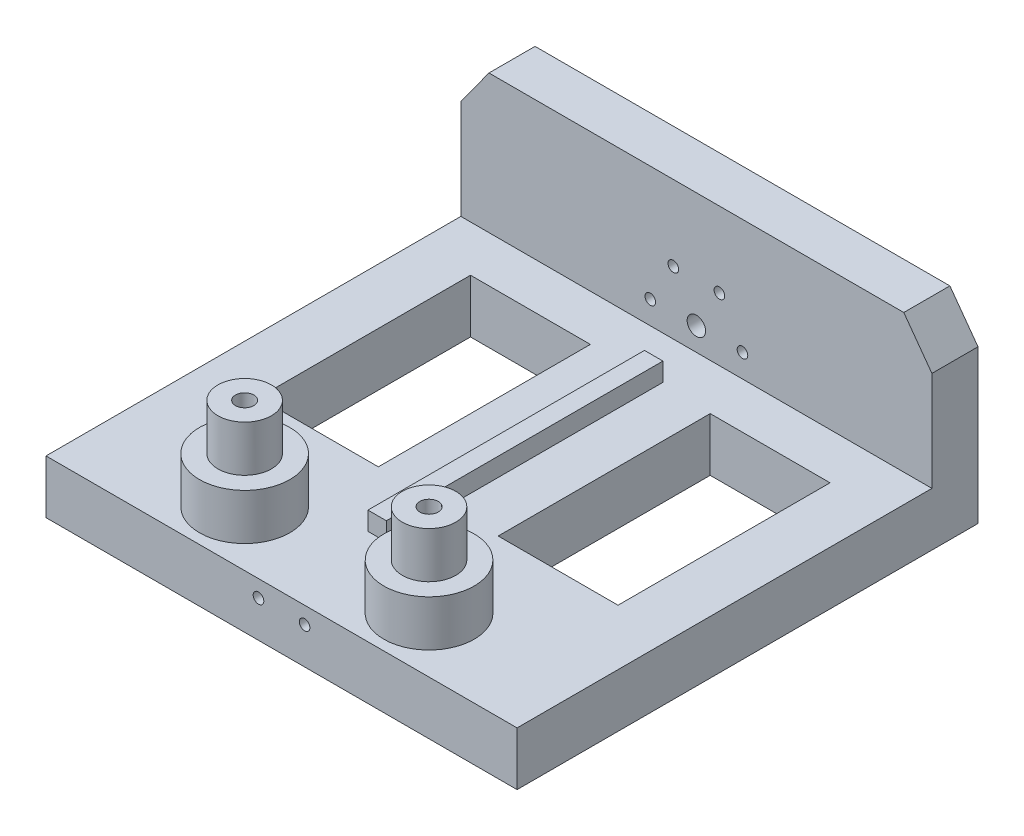
ISO-10303-21;
HEADER;
FILE_DESCRIPTION(('STEP AP214'),'2;1');
FILE_NAME('part.step','',(''),(''),'','','');
FILE_SCHEMA(('AUTOMOTIVE_DESIGN { 1 0 10303 214 1 1 1 1 }'));
ENDSEC;
DATA;
#1=APPLICATION_CONTEXT('core data for automotive mechanical design processes');
#2=APPLICATION_PROTOCOL_DEFINITION('international standard','automotive_design',2000,#1);
#3=PRODUCT_CONTEXT('',#1,'mechanical');
#4=PRODUCT('Part','Part','',(#3));
#5=PRODUCT_RELATED_PRODUCT_CATEGORY('part','',(#4));
#6=PRODUCT_DEFINITION_FORMATION('','',#4);
#7=PRODUCT_DEFINITION_CONTEXT('part definition',#1,'design');
#8=PRODUCT_DEFINITION('design','',#6,#7);
#9=PRODUCT_DEFINITION_SHAPE('','',#8);
#10=(LENGTH_UNIT() NAMED_UNIT(*) SI_UNIT(.MILLI.,.METRE.));
#11=(NAMED_UNIT(*) PLANE_ANGLE_UNIT() SI_UNIT($,.RADIAN.));
#12=(NAMED_UNIT(*) SI_UNIT($,.STERADIAN.) SOLID_ANGLE_UNIT());
#13=UNCERTAINTY_MEASURE_WITH_UNIT(LENGTH_MEASURE(1.E-05),#10,'distance_accuracy_value','');
#14=(GEOMETRIC_REPRESENTATION_CONTEXT(3) GLOBAL_UNCERTAINTY_ASSIGNED_CONTEXT((#13)) GLOBAL_UNIT_ASSIGNED_CONTEXT((#10,
#11,#12)) REPRESENTATION_CONTEXT('',''));
#15=CARTESIAN_POINT('',(0.,0.,0.));
#16=DIRECTION('',(0.,0.,1.));
#17=DIRECTION('',(1.,0.,0.));
#18=AXIS2_PLACEMENT_3D('',#15,#16,#17);
#19=CARTESIAN_POINT('',(0.,-2.5,50.));
#20=DIRECTION('',(0.,1.,0.));
#21=DIRECTION('',(0.,0.,1.));
#22=AXIS2_PLACEMENT_3D('',#19,#20,#21);
#23=PLANE('',#22);
#24=CARTESIAN_POINT('',(-9.99999999999999,-2.5,44.));
#25=DIRECTION('',(0.,1.,0.));
#26=DIRECTION('',(0.,0.,1.));
#27=AXIS2_PLACEMENT_3D('',#24,#25,#26);
#28=CIRCLE('',#27,4.9);
#29=CARTESIAN_POINT('',(-9.99999999999999,-2.5,48.9));
#30=VERTEX_POINT('',#29);
#31=EDGE_CURVE('E259',#30,#30,#28,.T.);
#32=ORIENTED_EDGE('',*,*,#31,.F.);
#33=EDGE_LOOP('',(#32));
#34=FACE_BOUND('',#33,.T.);
#35=DIRECTION('',(0.,0.,1.));
#36=VECTOR('',#35,1.);
#37=CARTESIAN_POINT('',(6.50000000000001,-2.5,33.));
#38=LINE('',#37,#36);
#39=CARTESIAN_POINT('',(6.50000000000001,-2.5,10.));
#40=VERTEX_POINT('',#39);
#41=CARTESIAN_POINT('',(6.50000000000001,-2.5,33.));
#42=VERTEX_POINT('',#41);
#43=EDGE_CURVE('E262',#40,#42,#38,.T.);
#44=ORIENTED_EDGE('',*,*,#43,.F.);
#45=DIRECTION('',(-1.,0.,0.));
#46=VECTOR('',#45,1.);
#47=CARTESIAN_POINT('',(19.5,-2.5,10.));
#48=LINE('',#47,#46);
#49=CARTESIAN_POINT('',(19.5,-2.5,10.));
#50=VERTEX_POINT('',#49);
#51=EDGE_CURVE('E275',#50,#40,#48,.T.);
#52=ORIENTED_EDGE('',*,*,#51,.F.);
#53=DIRECTION('',(0.,0.,-1.));
#54=VECTOR('',#53,1.);
#55=CARTESIAN_POINT('',(19.5,-2.5,33.));
#56=LINE('',#55,#54);
#57=CARTESIAN_POINT('',(19.5,-2.5,33.));
#58=VERTEX_POINT('',#57);
#59=EDGE_CURVE('E271',#58,#50,#56,.T.);
#60=ORIENTED_EDGE('',*,*,#59,.F.);
#61=DIRECTION('',(1.,0.,0.));
#62=VECTOR('',#61,1.);
#63=CARTESIAN_POINT('',(19.5,-2.5,33.));
#64=LINE('',#63,#62);
#65=EDGE_CURVE('E266',#42,#58,#64,.T.);
#66=ORIENTED_EDGE('',*,*,#65,.F.);
#67=EDGE_LOOP('',(#44,#52,#60,#66));
#68=FACE_BOUND('',#67,.T.);
#69=DIRECTION('',(0.,0.,1.));
#70=VECTOR('',#69,1.);
#71=CARTESIAN_POINT('',(-19.5,-2.5,33.));
#72=LINE('',#71,#70);
#73=CARTESIAN_POINT('',(-19.5,-2.5,10.));
#74=VERTEX_POINT('',#73);
#75=CARTESIAN_POINT('',(-19.5,-2.5,33.));
#76=VERTEX_POINT('',#75);
#77=EDGE_CURVE('E256',#74,#76,#72,.T.);
#78=ORIENTED_EDGE('',*,*,#77,.F.);
#79=DIRECTION('',(-1.,0.,0.));
#80=VECTOR('',#79,1.);
#81=CARTESIAN_POINT('',(-19.5,-2.5,10.));
#82=LINE('',#81,#80);
#83=CARTESIAN_POINT('',(-6.50000000000001,-2.5,10.));
#84=VERTEX_POINT('',#83);
#85=EDGE_CURVE('E303',#84,#74,#82,.T.);
#86=ORIENTED_EDGE('',*,*,#85,.F.);
#87=DIRECTION('',(0.,0.,-1.));
#88=VECTOR('',#87,1.);
#89=CARTESIAN_POINT('',(-6.50000000000001,-2.5,33.));
#90=LINE('',#89,#88);
#91=CARTESIAN_POINT('',(-6.50000000000001,-2.5,33.));
#92=VERTEX_POINT('',#91);
#93=EDGE_CURVE('E299',#92,#84,#90,.T.);
#94=ORIENTED_EDGE('',*,*,#93,.F.);
#95=DIRECTION('',(1.,0.,0.));
#96=VECTOR('',#95,1.);
#97=CARTESIAN_POINT('',(-19.5,-2.5,33.));
#98=LINE('',#97,#96);
#99=EDGE_CURVE('E295',#76,#92,#98,.T.);
#100=ORIENTED_EDGE('',*,*,#99,.F.);
#101=EDGE_LOOP('',(#78,#86,#94,#100));
#102=FACE_BOUND('',#101,.T.);
#103=DIRECTION('',(1.,0.,0.));
#104=VECTOR('',#103,1.);
#105=CARTESIAN_POINT('',(0.,-2.5,5.));
#106=LINE('',#105,#104);
#107=CARTESIAN_POINT('',(-25.5501980270922,-2.5,5.));
#108=VERTEX_POINT('',#107);
#109=CARTESIAN_POINT('',(25.5501980270922,-2.5,5.));
#110=VERTEX_POINT('',#109);
#111=EDGE_CURVE('E358',#108,#110,#106,.T.);
#112=ORIENTED_EDGE('',*,*,#111,.F.);
#113=DIRECTION('',(0.,0.,-1.));
#114=VECTOR('',#113,1.);
#115=CARTESIAN_POINT('',(-25.5501980270922,-2.5,50.));
#116=LINE('',#115,#114);
#117=CARTESIAN_POINT('',(-25.5501980270922,-2.5,50.));
#118=VERTEX_POINT('',#117);
#119=EDGE_CURVE('E383',#118,#108,#116,.T.);
#120=ORIENTED_EDGE('',*,*,#119,.F.);
#121=DIRECTION('',(1.,0.,0.));
#122=VECTOR('',#121,1.);
#123=CARTESIAN_POINT('',(0.,-2.5,50.));
#124=LINE('',#123,#122);
#125=CARTESIAN_POINT('',(25.5501980270922,-2.5,50.));
#126=VERTEX_POINT('',#125);
#127=EDGE_CURVE('E359',#118,#126,#124,.T.);
#128=ORIENTED_EDGE('',*,*,#127,.T.);
#129=DIRECTION('',(0.,0.,-1.));
#130=VECTOR('',#129,1.);
#131=CARTESIAN_POINT('',(25.5501980270922,-2.5,50.));
#132=LINE('',#131,#130);
#133=EDGE_CURVE('E377',#126,#110,#132,.T.);
#134=ORIENTED_EDGE('',*,*,#133,.T.);
#135=EDGE_LOOP('',(#112,#120,#128,#134));
#136=FACE_BOUND('',#135,.T.);
#137=DIRECTION('',(1.,0.,0.));
#138=VECTOR('',#137,1.);
#139=CARTESIAN_POINT('',(1.00000000000001,-2.5,39.6289253842812));
#140=LINE('',#139,#138);
#141=CARTESIAN_POINT('',(-0.999999999999991,-2.5,39.6289253842812));
#142=VERTEX_POINT('',#141);
#143=CARTESIAN_POINT('',(1.00000000000001,-2.5,39.6289253842812));
#144=VERTEX_POINT('',#143);
#145=EDGE_CURVE('E336',#142,#144,#140,.T.);
#146=ORIENTED_EDGE('',*,*,#145,.F.);
#147=DIRECTION('',(0.,0.,1.));
#148=VECTOR('',#147,1.);
#149=CARTESIAN_POINT('',(-1.,-2.5,9.62892538428119));
#150=LINE('',#149,#148);
#151=CARTESIAN_POINT('',(-1.,-2.5,9.62892538428119));
#152=VERTEX_POINT('',#151);
#153=EDGE_CURVE('E283',#152,#142,#150,.T.);
#154=ORIENTED_EDGE('',*,*,#153,.F.);
#155=DIRECTION('',(-1.,0.,0.));
#156=VECTOR('',#155,1.);
#157=CARTESIAN_POINT('',(1.,-2.5,9.62892538428119));
#158=LINE('',#157,#156);
#159=CARTESIAN_POINT('',(1.,-2.5,9.62892538428119));
#160=VERTEX_POINT('',#159);
#161=EDGE_CURVE('E323',#160,#152,#158,.T.);
#162=ORIENTED_EDGE('',*,*,#161,.F.);
#163=DIRECTION('',(0.,0.,-1.));
#164=VECTOR('',#163,1.);
#165=CARTESIAN_POINT('',(1.,-2.5,9.62892538428119));
#166=LINE('',#165,#164);
#167=EDGE_CURVE('E339',#144,#160,#166,.T.);
#168=ORIENTED_EDGE('',*,*,#167,.F.);
#169=EDGE_LOOP('',(#146,#154,#162,#168));
#170=FACE_BOUND('',#169,.T.);
#171=CARTESIAN_POINT('',(10.,-2.5,44.));
#172=DIRECTION('',(0.,1.,0.));
#173=DIRECTION('',(0.,0.,1.));
#174=AXIS2_PLACEMENT_3D('',#171,#172,#173);
#175=CIRCLE('',#174,4.9);
#176=CARTESIAN_POINT('',(10.,-2.5,48.9));
#177=VERTEX_POINT('',#176);
#178=EDGE_CURVE('E482',#177,#177,#175,.T.);
#179=ORIENTED_EDGE('',*,*,#178,.F.);
#180=EDGE_LOOP('',(#179));
#181=FACE_BOUND('',#180,.T.);
#182=ADVANCED_FACE('F45',(#34,#68,#102,#136,#170,#181),#23,.T.);
#183=CARTESIAN_POINT('',(0.,0.,5.));
#184=DIRECTION('',(0.,0.,1.));
#185=DIRECTION('',(1.,0.,0.));
#186=AXIS2_PLACEMENT_3D('',#183,#184,#185);
#187=PLANE('',#186);
#188=CARTESIAN_POINT('',(5.,0.,5.));
#189=DIRECTION('',(0.,0.,1.));
#190=DIRECTION('',(1.,0.,0.));
#191=AXIS2_PLACEMENT_3D('',#188,#189,#190);
#192=CIRCLE('',#191,0.575);
#193=CARTESIAN_POINT('',(5.575,0.,5.));
#194=VERTEX_POINT('',#193);
#195=EDGE_CURVE('E395',#194,#194,#192,.T.);
#196=ORIENTED_EDGE('',*,*,#195,.F.);
#197=EDGE_LOOP('',(#196));
#198=FACE_BOUND('',#197,.T.);
#199=CARTESIAN_POINT('',(-2.49999999999999,4.3301270189222,5.));
#200=DIRECTION('',(0.,0.,1.));
#201=DIRECTION('',(1.,0.,0.));
#202=AXIS2_PLACEMENT_3D('',#199,#200,#201);
#203=CIRCLE('',#202,0.575);
#204=CARTESIAN_POINT('',(-1.92499999999999,4.3301270189222,5.));
#205=VERTEX_POINT('',#204);
#206=EDGE_CURVE('E411',#205,#205,#203,.T.);
#207=ORIENTED_EDGE('',*,*,#206,.F.);
#208=EDGE_LOOP('',(#207));
#209=FACE_BOUND('',#208,.T.);
#210=CARTESIAN_POINT('',(0.,0.,5.));
#211=DIRECTION('',(0.,0.,1.));
#212=DIRECTION('',(1.,0.,0.));
#213=AXIS2_PLACEMENT_3D('',#210,#211,#212);
#214=CIRCLE('',#213,1.);
#215=CARTESIAN_POINT('',(1.,0.,5.));
#216=VERTEX_POINT('',#215);
#217=EDGE_CURVE('E427',#216,#216,#214,.T.);
#218=ORIENTED_EDGE('',*,*,#217,.F.);
#219=EDGE_LOOP('',(#218));
#220=FACE_BOUND('',#219,.T.);
#221=CARTESIAN_POINT('',(-5.,0.,5.));
#222=DIRECTION('',(0.,0.,1.));
#223=DIRECTION('',(1.,0.,0.));
#224=AXIS2_PLACEMENT_3D('',#221,#222,#223);
#225=CIRCLE('',#224,0.575);
#226=CARTESIAN_POINT('',(-4.425,0.,5.));
#227=VERTEX_POINT('',#226);
#228=EDGE_CURVE('E419',#227,#227,#225,.T.);
#229=ORIENTED_EDGE('',*,*,#228,.F.);
#230=EDGE_LOOP('',(#229));
#231=FACE_BOUND('',#230,.T.);
#232=CARTESIAN_POINT('',(2.50000000000002,4.33012701892218,5.));
#233=DIRECTION('',(0.,0.,1.));
#234=DIRECTION('',(1.,0.,0.));
#235=AXIS2_PLACEMENT_3D('',#232,#233,#234);
#236=CIRCLE('',#235,0.575);
#237=CARTESIAN_POINT('',(3.07500000000002,4.33012701892218,5.));
#238=VERTEX_POINT('',#237);
#239=EDGE_CURVE('E403',#238,#238,#236,.T.);
#240=ORIENTED_EDGE('',*,*,#239,.F.);
#241=EDGE_LOOP('',(#240));
#242=FACE_BOUND('',#241,.T.);
#243=DIRECTION('',(0.,-1.,0.));
#244=VECTOR('',#243,1.);
#245=CARTESIAN_POINT('',(-25.5501980270922,8.30176258165341,5.));
#246=LINE('',#245,#244);
#247=CARTESIAN_POINT('',(-25.5501980270922,8.30176258165341,5.));
#248=VERTEX_POINT('',#247);
#249=EDGE_CURVE('E437',#248,#108,#246,.T.);
#250=ORIENTED_EDGE('',*,*,#249,.T.);
#251=ORIENTED_EDGE('',*,*,#111,.T.);
#252=DIRECTION('',(0.,1.,0.));
#253=VECTOR('',#252,1.);
#254=CARTESIAN_POINT('',(25.5501980270922,-8.30176258165341,5.));
#255=LINE('',#254,#253);
#256=CARTESIAN_POINT('',(25.5501980270922,8.30176258165341,5.));
#257=VERTEX_POINT('',#256);
#258=EDGE_CURVE('E441',#110,#257,#255,.T.);
#259=ORIENTED_EDGE('',*,*,#258,.T.);
#260=DIRECTION('',(-0.587785252292473,0.809016994374947,0.));
#261=VECTOR('',#260,1.);
#262=CARTESIAN_POINT('',(25.5501980270922,8.30176258165341,5.));
#263=LINE('',#262,#261);
#264=CARTESIAN_POINT('',(22.5,12.5,5.));
#265=VERTEX_POINT('',#264);
#266=EDGE_CURVE('E444',#257,#265,#263,.T.);
#267=ORIENTED_EDGE('',*,*,#266,.T.);
#268=DIRECTION('',(-1.,0.,0.));
#269=VECTOR('',#268,1.);
#270=CARTESIAN_POINT('',(-22.5,12.5,5.));
#271=LINE('',#270,#269);
#272=CARTESIAN_POINT('',(-22.5,12.5,5.));
#273=VERTEX_POINT('',#272);
#274=EDGE_CURVE('E230',#265,#273,#271,.T.);
#275=ORIENTED_EDGE('',*,*,#274,.T.);
#276=DIRECTION('',(-0.587785252292473,-0.809016994374947,0.));
#277=VECTOR('',#276,1.);
#278=CARTESIAN_POINT('',(-22.5,12.5,5.));
#279=LINE('',#278,#277);
#280=EDGE_CURVE('E224',#273,#248,#279,.T.);
#281=ORIENTED_EDGE('',*,*,#280,.T.);
#282=EDGE_LOOP('',(#250,#251,#259,#267,#275,#281));
#283=FACE_BOUND('',#282,.T.);
#284=ADVANCED_FACE('F460',(#198,#209,#220,#231,#242,#283),#187,.T.);
#285=CARTESIAN_POINT('',(0.,0.,0.));
#286=DIRECTION('',(0.,0.,1.));
#287=DIRECTION('',(1.,0.,0.));
#288=AXIS2_PLACEMENT_3D('',#285,#286,#287);
#289=PLANE('',#288);
#290=DIRECTION('',(0.,1.,0.));
#291=VECTOR('',#290,1.);
#292=CARTESIAN_POINT('',(25.5501980270922,-8.30176258165341,0.));
#293=LINE('',#292,#291);
#294=CARTESIAN_POINT('',(25.5501980270922,-8.30176258165341,0.));
#295=VERTEX_POINT('',#294);
#296=CARTESIAN_POINT('',(25.5501980270922,8.30176258165341,0.));
#297=VERTEX_POINT('',#296);
#298=EDGE_CURVE('E199',#295,#297,#293,.T.);
#299=ORIENTED_EDGE('',*,*,#298,.F.);
#300=DIRECTION('',(-1.,0.,0.));
#301=VECTOR('',#300,1.);
#302=CARTESIAN_POINT('',(25.5501980270922,-8.30176258165341,0.));
#303=LINE('',#302,#301);
#304=CARTESIAN_POINT('',(-25.5501980270922,-8.30176258165341,0.));
#305=VERTEX_POINT('',#304);
#306=EDGE_CURVE('E184',#295,#305,#303,.T.);
#307=ORIENTED_EDGE('',*,*,#306,.T.);
#308=DIRECTION('',(0.,-1.,0.));
#309=VECTOR('',#308,1.);
#310=CARTESIAN_POINT('',(-25.5501980270922,8.30176258165341,0.));
#311=LINE('',#310,#309);
#312=CARTESIAN_POINT('',(-25.5501980270922,8.30176258165341,0.));
#313=VERTEX_POINT('',#312);
#314=EDGE_CURVE('E212',#313,#305,#311,.T.);
#315=ORIENTED_EDGE('',*,*,#314,.F.);
#316=DIRECTION('',(-0.587785252292473,-0.809016994374947,0.));
#317=VECTOR('',#316,1.);
#318=CARTESIAN_POINT('',(-22.5,12.5,0.));
#319=LINE('',#318,#317);
#320=CARTESIAN_POINT('',(-22.5,12.5,0.));
#321=VERTEX_POINT('',#320);
#322=EDGE_CURVE('E218',#321,#313,#319,.T.);
#323=ORIENTED_EDGE('',*,*,#322,.F.);
#324=DIRECTION('',(-1.,0.,0.));
#325=VECTOR('',#324,1.);
#326=CARTESIAN_POINT('',(-22.5,12.5,0.));
#327=LINE('',#326,#325);
#328=CARTESIAN_POINT('',(22.5,12.5,0.));
#329=VERTEX_POINT('',#328);
#330=EDGE_CURVE('E216',#329,#321,#327,.T.);
#331=ORIENTED_EDGE('',*,*,#330,.F.);
#332=DIRECTION('',(-0.587785252292473,0.809016994374947,0.));
#333=VECTOR('',#332,1.);
#334=CARTESIAN_POINT('',(25.5501980270922,8.30176258165341,0.));
#335=LINE('',#334,#333);
#336=EDGE_CURVE('E210',#297,#329,#335,.T.);
#337=ORIENTED_EDGE('',*,*,#336,.F.);
#338=EDGE_LOOP('',(#299,#307,#315,#323,#331,#337));
#339=FACE_BOUND('',#338,.T.);
#340=CARTESIAN_POINT('',(0.,0.,0.));
#341=DIRECTION('',(0.,0.,1.));
#342=DIRECTION('',(1.,0.,0.));
#343=AXIS2_PLACEMENT_3D('',#340,#341,#342);
#344=CIRCLE('',#343,1.);
#345=CARTESIAN_POINT('',(1.,0.,0.));
#346=VERTEX_POINT('',#345);
#347=EDGE_CURVE('E423',#346,#346,#344,.T.);
#348=ORIENTED_EDGE('',*,*,#347,.T.);
#349=EDGE_LOOP('',(#348));
#350=FACE_BOUND('',#349,.T.);
#351=CARTESIAN_POINT('',(-5.,0.,0.));
#352=DIRECTION('',(0.,0.,1.));
#353=DIRECTION('',(1.,0.,0.));
#354=AXIS2_PLACEMENT_3D('',#351,#352,#353);
#355=CIRCLE('',#354,0.575);
#356=CARTESIAN_POINT('',(-4.425,0.,0.));
#357=VERTEX_POINT('',#356);
#358=EDGE_CURVE('E415',#357,#357,#355,.T.);
#359=ORIENTED_EDGE('',*,*,#358,.T.);
#360=EDGE_LOOP('',(#359));
#361=FACE_BOUND('',#360,.T.);
#362=CARTESIAN_POINT('',(-2.49999999999999,4.3301270189222,0.));
#363=DIRECTION('',(0.,0.,1.));
#364=DIRECTION('',(1.,0.,0.));
#365=AXIS2_PLACEMENT_3D('',#362,#363,#364);
#366=CIRCLE('',#365,0.575);
#367=CARTESIAN_POINT('',(-1.92499999999999,4.3301270189222,0.));
#368=VERTEX_POINT('',#367);
#369=EDGE_CURVE('E407',#368,#368,#366,.T.);
#370=ORIENTED_EDGE('',*,*,#369,.T.);
#371=EDGE_LOOP('',(#370));
#372=FACE_BOUND('',#371,.T.);
#373=CARTESIAN_POINT('',(2.50000000000002,4.33012701892218,0.));
#374=DIRECTION('',(0.,0.,1.));
#375=DIRECTION('',(1.,0.,0.));
#376=AXIS2_PLACEMENT_3D('',#373,#374,#375);
#377=CIRCLE('',#376,0.575);
#378=CARTESIAN_POINT('',(3.07500000000002,4.33012701892218,0.));
#379=VERTEX_POINT('',#378);
#380=EDGE_CURVE('E399',#379,#379,#377,.T.);
#381=ORIENTED_EDGE('',*,*,#380,.T.);
#382=EDGE_LOOP('',(#381));
#383=FACE_BOUND('',#382,.T.);
#384=CARTESIAN_POINT('',(5.,0.,0.));
#385=DIRECTION('',(0.,0.,1.));
#386=DIRECTION('',(1.,0.,0.));
#387=AXIS2_PLACEMENT_3D('',#384,#385,#386);
#388=CIRCLE('',#387,0.575);
#389=CARTESIAN_POINT('',(5.575,0.,0.));
#390=VERTEX_POINT('',#389);
#391=EDGE_CURVE('E394',#390,#390,#388,.T.);
#392=ORIENTED_EDGE('',*,*,#391,.T.);
#393=EDGE_LOOP('',(#392));
#394=FACE_BOUND('',#393,.T.);
#395=CARTESIAN_POINT('',(2.49999999999996,-4.33012701892221,0.));
#396=DIRECTION('',(0.,0.,1.));
#397=DIRECTION('',(1.,0.,0.));
#398=AXIS2_PLACEMENT_3D('',#395,#396,#397);
#399=CIRCLE('',#398,0.575);
#400=CARTESIAN_POINT('',(3.07499999999996,-4.33012701892221,0.));
#401=VERTEX_POINT('',#400);
#402=EDGE_CURVE('E390',#401,#401,#399,.T.);
#403=ORIENTED_EDGE('',*,*,#402,.T.);
#404=EDGE_LOOP('',(#403));
#405=FACE_BOUND('',#404,.T.);
#406=CARTESIAN_POINT('',(-2.50000000000005,-4.33012701892216,0.));
#407=DIRECTION('',(0.,0.,1.));
#408=DIRECTION('',(1.,0.,0.));
#409=AXIS2_PLACEMENT_3D('',#406,#407,#408);
#410=CIRCLE('',#409,0.575000000000001);
#411=CARTESIAN_POINT('',(-1.92500000000005,-4.33012701892216,0.));
#412=VERTEX_POINT('',#411);
#413=EDGE_CURVE('E386',#412,#412,#410,.T.);
#414=ORIENTED_EDGE('',*,*,#413,.T.);
#415=EDGE_LOOP('',(#414));
#416=FACE_BOUND('',#415,.T.);
#417=ADVANCED_FACE('F207',(#339,#350,#361,#372,#383,#394,#405,#416),#289,.F.);
#418=CARTESIAN_POINT('',(-22.5,12.5,5.));
#419=DIRECTION('',(0.809016994374947,-0.587785252292473,0.));
#420=DIRECTION('',(0.587785252292473,0.809016994374947,0.));
#421=AXIS2_PLACEMENT_3D('',#418,#419,#420);
#422=PLANE('',#421);
#423=ORIENTED_EDGE('',*,*,#322,.T.);
#424=DIRECTION('',(0.,0.,-1.));
#425=VECTOR('',#424,1.);
#426=CARTESIAN_POINT('',(-25.5501980270922,8.30176258165341,5.));
#427=LINE('',#426,#425);
#428=EDGE_CURVE('E11',#248,#313,#427,.T.);
#429=ORIENTED_EDGE('',*,*,#428,.F.);
#430=ORIENTED_EDGE('',*,*,#280,.F.);
#431=DIRECTION('',(0.,0.,-1.));
#432=VECTOR('',#431,1.);
#433=CARTESIAN_POINT('',(-22.5,12.5,5.));
#434=LINE('',#433,#432);
#435=EDGE_CURVE('E225',#273,#321,#434,.T.);
#436=ORIENTED_EDGE('',*,*,#435,.T.);
#437=EDGE_LOOP('',(#423,#429,#430,#436));
#438=FACE_BOUND('',#437,.T.);
#439=ADVANCED_FACE('F47',(#438),#422,.F.);
#440=CARTESIAN_POINT('',(-25.5501980270922,8.30176258165341,5.));
#441=DIRECTION('',(1.,0.,0.));
#442=DIRECTION('',(0.,0.,-1.));
#443=AXIS2_PLACEMENT_3D('',#440,#441,#442);
#444=PLANE('',#443);
#445=ORIENTED_EDGE('',*,*,#314,.T.);
#446=DIRECTION('',(0.,0.,-1.));
#447=VECTOR('',#446,1.);
#448=CARTESIAN_POINT('',(-25.5501980270922,-8.30176258165341,5.));
#449=LINE('',#448,#447);
#450=CARTESIAN_POINT('',(-25.5501980270922,-8.30176258165341,50.));
#451=VERTEX_POINT('',#450);
#452=EDGE_CURVE('E55',#451,#305,#449,.T.);
#453=ORIENTED_EDGE('',*,*,#452,.F.);
#454=DIRECTION('',(0.,-1.,0.));
#455=VECTOR('',#454,1.);
#456=CARTESIAN_POINT('',(-25.5501980270922,0.,50.));
#457=LINE('',#456,#455);
#458=EDGE_CURVE('E363',#118,#451,#457,.T.);
#459=ORIENTED_EDGE('',*,*,#458,.F.);
#460=ORIENTED_EDGE('',*,*,#119,.T.);
#461=ORIENTED_EDGE('',*,*,#249,.F.);
#462=ORIENTED_EDGE('',*,*,#428,.T.);
#463=EDGE_LOOP('',(#445,#453,#459,#460,#461,#462));
#464=FACE_BOUND('',#463,.T.);
#465=ADVANCED_FACE('F456',(#464),#444,.F.);
#466=CARTESIAN_POINT('',(25.5501980270922,-8.30176258165341,5.));
#467=DIRECTION('',(-1.,0.,0.));
#468=DIRECTION('',(0.,0.,1.));
#469=AXIS2_PLACEMENT_3D('',#466,#467,#468);
#470=PLANE('',#469);
#471=ORIENTED_EDGE('',*,*,#298,.T.);
#472=DIRECTION('',(0.,0.,-1.));
#473=VECTOR('',#472,1.);
#474=CARTESIAN_POINT('',(25.5501980270922,8.30176258165341,5.));
#475=LINE('',#474,#473);
#476=EDGE_CURVE('E204',#257,#297,#475,.T.);
#477=ORIENTED_EDGE('',*,*,#476,.F.);
#478=ORIENTED_EDGE('',*,*,#258,.F.);
#479=ORIENTED_EDGE('',*,*,#133,.F.);
#480=DIRECTION('',(0.,1.,0.));
#481=VECTOR('',#480,1.);
#482=CARTESIAN_POINT('',(25.5501980270922,0.,50.));
#483=LINE('',#482,#481);
#484=CARTESIAN_POINT('',(25.5501980270922,-8.30176258165341,50.));
#485=VERTEX_POINT('',#484);
#486=EDGE_CURVE('E202',#485,#126,#483,.T.);
#487=ORIENTED_EDGE('',*,*,#486,.F.);
#488=DIRECTION('',(0.,0.,-1.));
#489=VECTOR('',#488,1.);
#490=CARTESIAN_POINT('',(25.5501980270922,-8.30176258165341,5.));
#491=LINE('',#490,#489);
#492=EDGE_CURVE('E187',#485,#295,#491,.T.);
#493=ORIENTED_EDGE('',*,*,#492,.T.);
#494=EDGE_LOOP('',(#471,#477,#478,#479,#487,#493));
#495=FACE_BOUND('',#494,.T.);
#496=ADVANCED_FACE('F197',(#495),#470,.F.);
#497=CARTESIAN_POINT('',(25.5501980270922,8.30176258165341,5.));
#498=DIRECTION('',(-0.809016994374947,-0.587785252292473,0.));
#499=DIRECTION('',(0.587785252292473,-0.809016994374948,0.));
#500=AXIS2_PLACEMENT_3D('',#497,#498,#499);
#501=PLANE('',#500);
#502=ORIENTED_EDGE('',*,*,#336,.T.);
#503=DIRECTION('',(0.,0.,-1.));
#504=VECTOR('',#503,1.);
#505=CARTESIAN_POINT('',(22.5,12.5,5.));
#506=LINE('',#505,#504);
#507=EDGE_CURVE('E229',#265,#329,#506,.T.);
#508=ORIENTED_EDGE('',*,*,#507,.F.);
#509=ORIENTED_EDGE('',*,*,#266,.F.);
#510=ORIENTED_EDGE('',*,*,#476,.T.);
#511=EDGE_LOOP('',(#502,#508,#509,#510));
#512=FACE_BOUND('',#511,.T.);
#513=ADVANCED_FACE('F467',(#512),#501,.F.);
#514=CARTESIAN_POINT('',(-22.5,12.5,5.));
#515=DIRECTION('',(0.,-1.,0.));
#516=DIRECTION('',(0.,0.,-1.));
#517=AXIS2_PLACEMENT_3D('',#514,#515,#516);
#518=PLANE('',#517);
#519=ORIENTED_EDGE('',*,*,#330,.T.);
#520=ORIENTED_EDGE('',*,*,#435,.F.);
#521=ORIENTED_EDGE('',*,*,#274,.F.);
#522=ORIENTED_EDGE('',*,*,#507,.T.);
#523=EDGE_LOOP('',(#519,#520,#521,#522));
#524=FACE_BOUND('',#523,.T.);
#525=ADVANCED_FACE('F465',(#524),#518,.F.);
#526=CARTESIAN_POINT('',(0.,0.,5.));
#527=DIRECTION('',(0.,0.,-1.));
#528=DIRECTION('',(-1.,0.,0.));
#529=AXIS2_PLACEMENT_3D('',#526,#527,#528);
#530=CYLINDRICAL_SURFACE('',#529,1.);
#531=ORIENTED_EDGE('',*,*,#217,.T.);
#532=EDGE_LOOP('',(#531));
#533=FACE_BOUND('',#532,.T.);
#534=ORIENTED_EDGE('',*,*,#347,.F.);
#535=EDGE_LOOP('',(#534));
#536=FACE_BOUND('',#535,.T.);
#537=ADVANCED_FACE('F644',(#533,#536),#530,.F.);
#538=CARTESIAN_POINT('',(-5.,0.,5.));
#539=DIRECTION('',(0.,0.,-1.));
#540=DIRECTION('',(-1.,0.,0.));
#541=AXIS2_PLACEMENT_3D('',#538,#539,#540);
#542=CYLINDRICAL_SURFACE('',#541,0.575);
#543=ORIENTED_EDGE('',*,*,#228,.T.);
#544=EDGE_LOOP('',(#543));
#545=FACE_BOUND('',#544,.T.);
#546=ORIENTED_EDGE('',*,*,#358,.F.);
#547=EDGE_LOOP('',(#546));
#548=FACE_BOUND('',#547,.T.);
#549=ADVANCED_FACE('F640',(#545,#548),#542,.F.);
#550=CARTESIAN_POINT('',(-2.49999999999999,4.3301270189222,5.));
#551=DIRECTION('',(0.,0.,-1.));
#552=DIRECTION('',(-1.,0.,0.));
#553=AXIS2_PLACEMENT_3D('',#550,#551,#552);
#554=CYLINDRICAL_SURFACE('',#553,0.575);
#555=ORIENTED_EDGE('',*,*,#206,.T.);
#556=EDGE_LOOP('',(#555));
#557=FACE_BOUND('',#556,.T.);
#558=ORIENTED_EDGE('',*,*,#369,.F.);
#559=EDGE_LOOP('',(#558));
#560=FACE_BOUND('',#559,.T.);
#561=ADVANCED_FACE('F636',(#557,#560),#554,.F.);
#562=CARTESIAN_POINT('',(2.50000000000002,4.33012701892218,5.));
#563=DIRECTION('',(0.,0.,-1.));
#564=DIRECTION('',(-1.,0.,0.));
#565=AXIS2_PLACEMENT_3D('',#562,#563,#564);
#566=CYLINDRICAL_SURFACE('',#565,0.575);
#567=ORIENTED_EDGE('',*,*,#239,.T.);
#568=EDGE_LOOP('',(#567));
#569=FACE_BOUND('',#568,.T.);
#570=ORIENTED_EDGE('',*,*,#380,.F.);
#571=EDGE_LOOP('',(#570));
#572=FACE_BOUND('',#571,.T.);
#573=ADVANCED_FACE('F632',(#569,#572),#566,.F.);
#574=CARTESIAN_POINT('',(5.,0.,5.));
#575=DIRECTION('',(0.,0.,-1.));
#576=DIRECTION('',(-1.,0.,0.));
#577=AXIS2_PLACEMENT_3D('',#574,#575,#576);
#578=CYLINDRICAL_SURFACE('',#577,0.575);
#579=ORIENTED_EDGE('',*,*,#195,.T.);
#580=EDGE_LOOP('',(#579));
#581=FACE_BOUND('',#580,.T.);
#582=ORIENTED_EDGE('',*,*,#391,.F.);
#583=EDGE_LOOP('',(#582));
#584=FACE_BOUND('',#583,.T.);
#585=ADVANCED_FACE('F628',(#581,#584),#578,.F.);
#586=CARTESIAN_POINT('',(2.49999999999996,-4.33012701892221,5.));
#587=DIRECTION('',(0.,0.,-1.));
#588=DIRECTION('',(-1.,0.,0.));
#589=AXIS2_PLACEMENT_3D('',#586,#587,#588);
#590=CYLINDRICAL_SURFACE('',#589,0.575);
#591=ORIENTED_EDGE('',*,*,#402,.F.);
#592=EDGE_LOOP('',(#591));
#593=FACE_BOUND('',#592,.T.);
#594=CARTESIAN_POINT('',(2.49999999999996,-4.33012701892221,50.));
#595=DIRECTION('',(0.,0.,1.));
#596=DIRECTION('',(1.,0.,0.));
#597=AXIS2_PLACEMENT_3D('',#594,#595,#596);
#598=CIRCLE('',#597,0.575);
#599=CARTESIAN_POINT('',(3.07499999999996,-4.33012701892221,50.));
#600=VERTEX_POINT('',#599);
#601=EDGE_CURVE('E373',#600,#600,#598,.F.);
#602=ORIENTED_EDGE('',*,*,#601,.F.);
#603=EDGE_LOOP('',(#602));
#604=FACE_BOUND('',#603,.T.);
#605=ADVANCED_FACE('F624',(#593,#604),#590,.F.);
#606=CARTESIAN_POINT('',(-2.50000000000005,-4.33012701892216,5.));
#607=DIRECTION('',(0.,0.,-1.));
#608=DIRECTION('',(-1.,0.,0.));
#609=AXIS2_PLACEMENT_3D('',#606,#607,#608);
#610=CYLINDRICAL_SURFACE('',#609,0.575000000000001);
#611=ORIENTED_EDGE('',*,*,#413,.F.);
#612=EDGE_LOOP('',(#611));
#613=FACE_BOUND('',#612,.T.);
#614=CARTESIAN_POINT('',(-2.50000000000005,-4.33012701892216,50.));
#615=DIRECTION('',(0.,0.,1.));
#616=DIRECTION('',(1.,0.,0.));
#617=AXIS2_PLACEMENT_3D('',#614,#615,#616);
#618=CIRCLE('',#617,0.575000000000001);
#619=CARTESIAN_POINT('',(-1.92500000000005,-4.33012701892216,50.));
#620=VERTEX_POINT('',#619);
#621=EDGE_CURVE('E369',#620,#620,#618,.F.);
#622=ORIENTED_EDGE('',*,*,#621,.F.);
#623=EDGE_LOOP('',(#622));
#624=FACE_BOUND('',#623,.T.);
#625=ADVANCED_FACE('F620',(#613,#624),#610,.F.);
#626=CARTESIAN_POINT('',(0.,0.,50.));
#627=DIRECTION('',(0.,0.,1.));
#628=DIRECTION('',(1.,0.,0.));
#629=AXIS2_PLACEMENT_3D('',#626,#627,#628);
#630=PLANE('',#629);
#631=DIRECTION('',(-1.,0.,0.));
#632=VECTOR('',#631,1.);
#633=CARTESIAN_POINT('',(0.,-8.30176258165341,50.));
#634=LINE('',#633,#632);
#635=EDGE_CURVE('E475',#485,#451,#634,.T.);
#636=ORIENTED_EDGE('',*,*,#635,.F.);
#637=ORIENTED_EDGE('',*,*,#486,.T.);
#638=ORIENTED_EDGE('',*,*,#127,.F.);
#639=ORIENTED_EDGE('',*,*,#458,.T.);
#640=EDGE_LOOP('',(#636,#637,#638,#639));
#641=FACE_BOUND('',#640,.T.);
#642=ORIENTED_EDGE('',*,*,#621,.T.);
#643=EDGE_LOOP('',(#642));
#644=FACE_BOUND('',#643,.T.);
#645=ORIENTED_EDGE('',*,*,#601,.T.);
#646=EDGE_LOOP('',(#645));
#647=FACE_BOUND('',#646,.T.);
#648=ADVANCED_FACE('F473',(#641,#644,#647),#630,.T.);
#649=CARTESIAN_POINT('',(-1.,-0.5,9.62892538428119));
#650=DIRECTION('',(1.,0.,0.));
#651=DIRECTION('',(0.,0.,-1.));
#652=AXIS2_PLACEMENT_3D('',#649,#650,#651);
#653=PLANE('',#652);
#654=ORIENTED_EDGE('',*,*,#153,.T.);
#655=DIRECTION('',(0.,-1.,0.));
#656=VECTOR('',#655,1.);
#657=CARTESIAN_POINT('',(-0.999999999999991,-0.5,39.6289253842812));
#658=LINE('',#657,#656);
#659=CARTESIAN_POINT('',(-0.999999999999991,-0.5,39.6289253842812));
#660=VERTEX_POINT('',#659);
#661=EDGE_CURVE('E355',#660,#142,#658,.T.);
#662=ORIENTED_EDGE('',*,*,#661,.F.);
#663=DIRECTION('',(0.,0.,1.));
#664=VECTOR('',#663,1.);
#665=CARTESIAN_POINT('',(-1.,-0.5,9.62892538428119));
#666=LINE('',#665,#664);
#667=CARTESIAN_POINT('',(-1.,-0.5,9.62892538428119));
#668=VERTEX_POINT('',#667);
#669=EDGE_CURVE('E318',#668,#660,#666,.T.);
#670=ORIENTED_EDGE('',*,*,#669,.F.);
#671=DIRECTION('',(0.,-1.,0.));
#672=VECTOR('',#671,1.);
#673=CARTESIAN_POINT('',(-1.,-0.5,9.62892538428119));
#674=LINE('',#673,#672);
#675=EDGE_CURVE('E332',#668,#152,#674,.T.);
#676=ORIENTED_EDGE('',*,*,#675,.T.);
#677=EDGE_LOOP('',(#654,#662,#670,#676));
#678=FACE_BOUND('',#677,.T.);
#679=ADVANCED_FACE('F614',(#678),#653,.F.);
#680=CARTESIAN_POINT('',(1.00000000000001,-0.5,39.6289253842812));
#681=DIRECTION('',(0.,0.,-1.));
#682=DIRECTION('',(-1.,0.,0.));
#683=AXIS2_PLACEMENT_3D('',#680,#681,#682);
#684=PLANE('',#683);
#685=ORIENTED_EDGE('',*,*,#145,.T.);
#686=DIRECTION('',(0.,-1.,0.));
#687=VECTOR('',#686,1.);
#688=CARTESIAN_POINT('',(1.00000000000001,-0.5,39.6289253842812));
#689=LINE('',#688,#687);
#690=CARTESIAN_POINT('',(1.00000000000001,-0.5,39.6289253842812));
#691=VERTEX_POINT('',#690);
#692=EDGE_CURVE('E351',#691,#144,#689,.T.);
#693=ORIENTED_EDGE('',*,*,#692,.F.);
#694=DIRECTION('',(1.,0.,0.));
#695=VECTOR('',#694,1.);
#696=CARTESIAN_POINT('',(1.00000000000001,-0.5,39.6289253842812));
#697=LINE('',#696,#695);
#698=EDGE_CURVE('E322',#660,#691,#697,.T.);
#699=ORIENTED_EDGE('',*,*,#698,.F.);
#700=ORIENTED_EDGE('',*,*,#661,.T.);
#701=EDGE_LOOP('',(#685,#693,#699,#700));
#702=FACE_BOUND('',#701,.T.);
#703=ADVANCED_FACE('F610',(#702),#684,.F.);
#704=CARTESIAN_POINT('',(1.,-0.5,9.62892538428119));
#705=DIRECTION('',(-1.,0.,0.));
#706=DIRECTION('',(0.,0.,1.));
#707=AXIS2_PLACEMENT_3D('',#704,#705,#706);
#708=PLANE('',#707);
#709=ORIENTED_EDGE('',*,*,#167,.T.);
#710=DIRECTION('',(0.,-1.,0.));
#711=VECTOR('',#710,1.);
#712=CARTESIAN_POINT('',(1.,-0.5,9.62892538428119));
#713=LINE('',#712,#711);
#714=CARTESIAN_POINT('',(1.,-0.5,9.62892538428119));
#715=VERTEX_POINT('',#714);
#716=EDGE_CURVE('E348',#715,#160,#713,.T.);
#717=ORIENTED_EDGE('',*,*,#716,.F.);
#718=DIRECTION('',(0.,0.,-1.));
#719=VECTOR('',#718,1.);
#720=CARTESIAN_POINT('',(1.,-0.5,9.62892538428119));
#721=LINE('',#720,#719);
#722=EDGE_CURVE('E326',#691,#715,#721,.T.);
#723=ORIENTED_EDGE('',*,*,#722,.F.);
#724=ORIENTED_EDGE('',*,*,#692,.T.);
#725=EDGE_LOOP('',(#709,#717,#723,#724));
#726=FACE_BOUND('',#725,.T.);
#727=ADVANCED_FACE('F606',(#726),#708,.F.);
#728=CARTESIAN_POINT('',(1.,-0.5,9.62892538428119));
#729=DIRECTION('',(0.,0.,1.));
#730=DIRECTION('',(1.,0.,0.));
#731=AXIS2_PLACEMENT_3D('',#728,#729,#730);
#732=PLANE('',#731);
#733=ORIENTED_EDGE('',*,*,#161,.T.);
#734=ORIENTED_EDGE('',*,*,#675,.F.);
#735=DIRECTION('',(-1.,0.,0.));
#736=VECTOR('',#735,1.);
#737=CARTESIAN_POINT('',(1.,-0.5,9.62892538428119));
#738=LINE('',#737,#736);
#739=EDGE_CURVE('E329',#715,#668,#738,.T.);
#740=ORIENTED_EDGE('',*,*,#739,.F.);
#741=ORIENTED_EDGE('',*,*,#716,.T.);
#742=EDGE_LOOP('',(#733,#734,#740,#741));
#743=FACE_BOUND('',#742,.T.);
#744=ADVANCED_FACE('F602',(#743),#732,.F.);
#745=CARTESIAN_POINT('',(0.,-0.5,0.));
#746=DIRECTION('',(0.,-1.,0.));
#747=DIRECTION('',(0.,0.,-1.));
#748=AXIS2_PLACEMENT_3D('',#745,#746,#747);
#749=PLANE('',#748);
#750=ORIENTED_EDGE('',*,*,#669,.T.);
#751=ORIENTED_EDGE('',*,*,#698,.T.);
#752=ORIENTED_EDGE('',*,*,#722,.T.);
#753=ORIENTED_EDGE('',*,*,#739,.T.);
#754=EDGE_LOOP('',(#750,#751,#752,#753));
#755=FACE_BOUND('',#754,.T.);
#756=ADVANCED_FACE('F599',(#755),#749,.F.);
#757=CARTESIAN_POINT('',(-19.5,-18.5,33.));
#758=DIRECTION('',(-1.,0.,0.));
#759=DIRECTION('',(0.,0.,1.));
#760=AXIS2_PLACEMENT_3D('',#757,#758,#759);
#761=PLANE('',#760);
#762=DIRECTION('',(0.,1.,0.));
#763=VECTOR('',#762,1.);
#764=CARTESIAN_POINT('',(-19.5,-18.5,33.));
#765=LINE('',#764,#763);
#766=CARTESIAN_POINT('',(-19.5,-8.30176258165341,33.));
#767=VERTEX_POINT('',#766);
#768=EDGE_CURVE('E307',#767,#76,#765,.T.);
#769=ORIENTED_EDGE('',*,*,#768,.F.);
#770=DIRECTION('',(0.,0.,-1.));
#771=VECTOR('',#770,1.);
#772=CARTESIAN_POINT('',(-19.5,-8.30176258165341,33.));
#773=LINE('',#772,#771);
#774=CARTESIAN_POINT('',(-19.5,-8.30176258165341,10.));
#775=VERTEX_POINT('',#774);
#776=EDGE_CURVE('E63',#767,#775,#773,.T.);
#777=ORIENTED_EDGE('',*,*,#776,.T.);
#778=DIRECTION('',(0.,1.,0.));
#779=VECTOR('',#778,1.);
#780=CARTESIAN_POINT('',(-19.5,-18.5,10.));
#781=LINE('',#780,#779);
#782=EDGE_CURVE('E267',#775,#74,#781,.T.);
#783=ORIENTED_EDGE('',*,*,#782,.T.);
#784=ORIENTED_EDGE('',*,*,#77,.T.);
#785=EDGE_LOOP('',(#769,#777,#783,#784));
#786=FACE_BOUND('',#785,.T.);
#787=ADVANCED_FACE('F521',(#786),#761,.F.);
#788=CARTESIAN_POINT('',(-19.5,-18.5,10.));
#789=DIRECTION('',(0.,0.,-1.));
#790=DIRECTION('',(-1.,0.,0.));
#791=AXIS2_PLACEMENT_3D('',#788,#789,#790);
#792=PLANE('',#791);
#793=ORIENTED_EDGE('',*,*,#782,.F.);
#794=DIRECTION('',(1.,0.,0.));
#795=VECTOR('',#794,1.);
#796=CARTESIAN_POINT('',(-19.5,-8.30176258165341,10.));
#797=LINE('',#796,#795);
#798=CARTESIAN_POINT('',(-6.50000000000001,-8.30176258165341,10.));
#799=VERTEX_POINT('',#798);
#800=EDGE_CURVE('E484',#775,#799,#797,.T.);
#801=ORIENTED_EDGE('',*,*,#800,.T.);
#802=DIRECTION('',(0.,1.,0.));
#803=VECTOR('',#802,1.);
#804=CARTESIAN_POINT('',(-6.50000000000001,-18.5,10.));
#805=LINE('',#804,#803);
#806=EDGE_CURVE('E310',#799,#84,#805,.T.);
#807=ORIENTED_EDGE('',*,*,#806,.T.);
#808=ORIENTED_EDGE('',*,*,#85,.T.);
#809=EDGE_LOOP('',(#793,#801,#807,#808));
#810=FACE_BOUND('',#809,.T.);
#811=ADVANCED_FACE('F525',(#810),#792,.F.);
#812=CARTESIAN_POINT('',(-6.50000000000001,-18.5,33.));
#813=DIRECTION('',(1.,0.,0.));
#814=DIRECTION('',(0.,0.,-1.));
#815=AXIS2_PLACEMENT_3D('',#812,#813,#814);
#816=PLANE('',#815);
#817=ORIENTED_EDGE('',*,*,#806,.F.);
#818=DIRECTION('',(0.,0.,1.));
#819=VECTOR('',#818,1.);
#820=CARTESIAN_POINT('',(-6.50000000000001,-8.30176258165341,33.));
#821=LINE('',#820,#819);
#822=CARTESIAN_POINT('',(-6.50000000000001,-8.30176258165341,33.));
#823=VERTEX_POINT('',#822);
#824=EDGE_CURVE('E531',#799,#823,#821,.T.);
#825=ORIENTED_EDGE('',*,*,#824,.T.);
#826=DIRECTION('',(0.,1.,0.));
#827=VECTOR('',#826,1.);
#828=CARTESIAN_POINT('',(-6.50000000000001,-18.5,33.));
#829=LINE('',#828,#827);
#830=EDGE_CURVE('E313',#823,#92,#829,.T.);
#831=ORIENTED_EDGE('',*,*,#830,.T.);
#832=ORIENTED_EDGE('',*,*,#93,.T.);
#833=EDGE_LOOP('',(#817,#825,#831,#832));
#834=FACE_BOUND('',#833,.T.);
#835=ADVANCED_FACE('F529',(#834),#816,.F.);
#836=CARTESIAN_POINT('',(-19.5,-18.5,33.));
#837=DIRECTION('',(0.,0.,1.));
#838=DIRECTION('',(1.,0.,0.));
#839=AXIS2_PLACEMENT_3D('',#836,#837,#838);
#840=PLANE('',#839);
#841=ORIENTED_EDGE('',*,*,#830,.F.);
#842=DIRECTION('',(-1.,0.,0.));
#843=VECTOR('',#842,1.);
#844=CARTESIAN_POINT('',(-19.5,-8.30176258165341,33.));
#845=LINE('',#844,#843);
#846=EDGE_CURVE('E534',#823,#767,#845,.T.);
#847=ORIENTED_EDGE('',*,*,#846,.T.);
#848=ORIENTED_EDGE('',*,*,#768,.T.);
#849=ORIENTED_EDGE('',*,*,#99,.T.);
#850=EDGE_LOOP('',(#841,#847,#848,#849));
#851=FACE_BOUND('',#850,.T.);
#852=ADVANCED_FACE('F533',(#851),#840,.F.);
#853=CARTESIAN_POINT('',(6.50000000000001,-18.5,33.));
#854=DIRECTION('',(-1.,0.,0.));
#855=DIRECTION('',(0.,0.,1.));
#856=AXIS2_PLACEMENT_3D('',#853,#854,#855);
#857=PLANE('',#856);
#858=DIRECTION('',(0.,1.,0.));
#859=VECTOR('',#858,1.);
#860=CARTESIAN_POINT('',(6.50000000000001,-18.5,33.));
#861=LINE('',#860,#859);
#862=CARTESIAN_POINT('',(6.50000000000001,-8.30176258165341,33.));
#863=VERTEX_POINT('',#862);
#864=EDGE_CURVE('E279',#863,#42,#861,.T.);
#865=ORIENTED_EDGE('',*,*,#864,.F.);
#866=DIRECTION('',(0.,0.,-1.));
#867=VECTOR('',#866,1.);
#868=CARTESIAN_POINT('',(6.50000000000001,-8.30176258165341,33.));
#869=LINE('',#868,#867);
#870=CARTESIAN_POINT('',(6.50000000000001,-8.30176258165341,10.));
#871=VERTEX_POINT('',#870);
#872=EDGE_CURVE('E71',#863,#871,#869,.T.);
#873=ORIENTED_EDGE('',*,*,#872,.T.);
#874=DIRECTION('',(0.,1.,0.));
#875=VECTOR('',#874,1.);
#876=CARTESIAN_POINT('',(6.50000000000001,-18.5,10.));
#877=LINE('',#876,#875);
#878=EDGE_CURVE('E280',#871,#40,#877,.T.);
#879=ORIENTED_EDGE('',*,*,#878,.T.);
#880=ORIENTED_EDGE('',*,*,#43,.T.);
#881=EDGE_LOOP('',(#865,#873,#879,#880));
#882=FACE_BOUND('',#881,.T.);
#883=ADVANCED_FACE('F581',(#882),#857,.F.);
#884=CARTESIAN_POINT('',(19.5,-18.5,10.));
#885=DIRECTION('',(0.,0.,-1.));
#886=DIRECTION('',(-1.,0.,0.));
#887=AXIS2_PLACEMENT_3D('',#884,#885,#886);
#888=PLANE('',#887);
#889=ORIENTED_EDGE('',*,*,#878,.F.);
#890=DIRECTION('',(1.,0.,0.));
#891=VECTOR('',#890,1.);
#892=CARTESIAN_POINT('',(19.5,-8.30176258165341,10.));
#893=LINE('',#892,#891);
#894=CARTESIAN_POINT('',(19.5,-8.30176258165341,10.));
#895=VERTEX_POINT('',#894);
#896=EDGE_CURVE('E540',#871,#895,#893,.T.);
#897=ORIENTED_EDGE('',*,*,#896,.T.);
#898=DIRECTION('',(0.,1.,0.));
#899=VECTOR('',#898,1.);
#900=CARTESIAN_POINT('',(19.5,-18.5,10.));
#901=LINE('',#900,#899);
#902=EDGE_CURVE('E284',#895,#50,#901,.T.);
#903=ORIENTED_EDGE('',*,*,#902,.T.);
#904=ORIENTED_EDGE('',*,*,#51,.T.);
#905=EDGE_LOOP('',(#889,#897,#903,#904));
#906=FACE_BOUND('',#905,.T.);
#907=ADVANCED_FACE('F579',(#906),#888,.F.);
#908=CARTESIAN_POINT('',(19.5,-18.5,33.));
#909=DIRECTION('',(1.,0.,0.));
#910=DIRECTION('',(0.,0.,-1.));
#911=AXIS2_PLACEMENT_3D('',#908,#909,#910);
#912=PLANE('',#911);
#913=ORIENTED_EDGE('',*,*,#902,.F.);
#914=DIRECTION('',(0.,0.,1.));
#915=VECTOR('',#914,1.);
#916=CARTESIAN_POINT('',(19.5,-8.30176258165341,33.));
#917=LINE('',#916,#915);
#918=CARTESIAN_POINT('',(19.5,-8.30176258165341,33.));
#919=VERTEX_POINT('',#918);
#920=EDGE_CURVE('E547',#895,#919,#917,.T.);
#921=ORIENTED_EDGE('',*,*,#920,.T.);
#922=DIRECTION('',(0.,1.,0.));
#923=VECTOR('',#922,1.);
#924=CARTESIAN_POINT('',(19.5,-18.5,33.));
#925=LINE('',#924,#923);
#926=EDGE_CURVE('E287',#919,#58,#925,.T.);
#927=ORIENTED_EDGE('',*,*,#926,.T.);
#928=ORIENTED_EDGE('',*,*,#59,.T.);
#929=EDGE_LOOP('',(#913,#921,#927,#928));
#930=FACE_BOUND('',#929,.T.);
#931=ADVANCED_FACE('F574',(#930),#912,.F.);
#932=CARTESIAN_POINT('',(19.5,-18.5,33.));
#933=DIRECTION('',(0.,0.,1.));
#934=DIRECTION('',(1.,0.,0.));
#935=AXIS2_PLACEMENT_3D('',#932,#933,#934);
#936=PLANE('',#935);
#937=ORIENTED_EDGE('',*,*,#926,.F.);
#938=DIRECTION('',(-1.,0.,0.));
#939=VECTOR('',#938,1.);
#940=CARTESIAN_POINT('',(19.5,-8.30176258165341,33.));
#941=LINE('',#940,#939);
#942=EDGE_CURVE('E551',#919,#863,#941,.T.);
#943=ORIENTED_EDGE('',*,*,#942,.T.);
#944=ORIENTED_EDGE('',*,*,#864,.T.);
#945=ORIENTED_EDGE('',*,*,#65,.T.);
#946=EDGE_LOOP('',(#937,#943,#944,#945));
#947=FACE_BOUND('',#946,.T.);
#948=ADVANCED_FACE('F575',(#947),#936,.F.);
#949=CARTESIAN_POINT('',(10.,7.5,44.));
#950=DIRECTION('',(0.,-1.,0.));
#951=DIRECTION('',(0.,0.,-1.));
#952=AXIS2_PLACEMENT_3D('',#949,#950,#951);
#953=CYLINDRICAL_SURFACE('',#952,2.9);
#954=CARTESIAN_POINT('',(10.,2.5,44.));
#955=DIRECTION('',(0.,1.,0.));
#956=DIRECTION('',(0.,0.,1.));
#957=AXIS2_PLACEMENT_3D('',#954,#955,#956);
#958=CIRCLE('',#957,2.9);
#959=CARTESIAN_POINT('',(10.,2.5,46.9));
#960=VERTEX_POINT('',#959);
#961=EDGE_CURVE('E477',#960,#960,#958,.T.);
#962=ORIENTED_EDGE('',*,*,#961,.T.);
#963=EDGE_LOOP('',(#962));
#964=FACE_BOUND('',#963,.T.);
#965=CARTESIAN_POINT('',(10.,7.5,44.));
#966=DIRECTION('',(0.,1.,0.));
#967=DIRECTION('',(0.,0.,1.));
#968=AXIS2_PLACEMENT_3D('',#965,#966,#967);
#969=CIRCLE('',#968,2.9);
#970=CARTESIAN_POINT('',(10.,7.5,46.9));
#971=VERTEX_POINT('',#970);
#972=EDGE_CURVE('E250',#971,#971,#969,.T.);
#973=ORIENTED_EDGE('',*,*,#972,.F.);
#974=EDGE_LOOP('',(#973));
#975=FACE_BOUND('',#974,.T.);
#976=ADVANCED_FACE('F742',(#964,#975),#953,.T.);
#977=CARTESIAN_POINT('',(10.,7.5,44.));
#978=DIRECTION('',(0.,1.,0.));
#979=DIRECTION('',(0.,0.,1.));
#980=AXIS2_PLACEMENT_3D('',#977,#978,#979);
#981=PLANE('',#980);
#982=CARTESIAN_POINT('',(10.,7.5,44.));
#983=DIRECTION('',(0.,1.,0.));
#984=DIRECTION('',(0.,0.,1.));
#985=AXIS2_PLACEMENT_3D('',#982,#983,#984);
#986=CIRCLE('',#985,1.);
#987=CARTESIAN_POINT('',(10.,7.5,45.));
#988=VERTEX_POINT('',#987);
#989=EDGE_CURVE('E241',#988,#988,#986,.T.);
#990=ORIENTED_EDGE('',*,*,#989,.F.);
#991=EDGE_LOOP('',(#990));
#992=FACE_BOUND('',#991,.T.);
#993=ORIENTED_EDGE('',*,*,#972,.T.);
#994=EDGE_LOOP('',(#993));
#995=FACE_BOUND('',#994,.T.);
#996=ADVANCED_FACE('F737',(#992,#995),#981,.T.);
#997=CARTESIAN_POINT('',(-9.99999999999999,7.5,44.));
#998=DIRECTION('',(0.,-1.,0.));
#999=DIRECTION('',(0.,0.,-1.));
#1000=AXIS2_PLACEMENT_3D('',#997,#998,#999);
#1001=CYLINDRICAL_SURFACE('',#1000,2.9);
#1002=CARTESIAN_POINT('',(-9.99999999999999,2.5,44.));
#1003=DIRECTION('',(0.,1.,0.));
#1004=DIRECTION('',(0.,0.,1.));
#1005=AXIS2_PLACEMENT_3D('',#1002,#1003,#1004);
#1006=CIRCLE('',#1005,2.9);
#1007=CARTESIAN_POINT('',(-9.99999999999999,2.5,46.9));
#1008=VERTEX_POINT('',#1007);
#1009=EDGE_CURVE('E492',#1008,#1008,#1006,.T.);
#1010=ORIENTED_EDGE('',*,*,#1009,.T.);
#1011=EDGE_LOOP('',(#1010));
#1012=FACE_BOUND('',#1011,.T.);
#1013=CARTESIAN_POINT('',(-9.99999999999999,7.5,44.));
#1014=DIRECTION('',(0.,1.,0.));
#1015=DIRECTION('',(0.,0.,-1.));
#1016=AXIS2_PLACEMENT_3D('',#1013,#1014,#1015);
#1017=CIRCLE('',#1016,2.9);
#1018=CARTESIAN_POINT('',(-9.99999999999999,7.5,41.1));
#1019=VERTEX_POINT('',#1018);
#1020=EDGE_CURVE('E245',#1019,#1019,#1017,.T.);
#1021=ORIENTED_EDGE('',*,*,#1020,.F.);
#1022=EDGE_LOOP('',(#1021));
#1023=FACE_BOUND('',#1022,.T.);
#1024=ADVANCED_FACE('F741',(#1012,#1023),#1001,.T.);
#1025=CARTESIAN_POINT('',(-9.99999999999999,7.5,44.));
#1026=DIRECTION('',(0.,-1.,0.));
#1027=DIRECTION('',(0.,0.,-1.));
#1028=AXIS2_PLACEMENT_3D('',#1025,#1026,#1027);
#1029=PLANE('',#1028);
#1030=CARTESIAN_POINT('',(-9.99999999999999,7.5,44.));
#1031=DIRECTION('',(0.,-1.,0.));
#1032=DIRECTION('',(0.,0.,-1.));
#1033=AXIS2_PLACEMENT_3D('',#1030,#1031,#1032);
#1034=CIRCLE('',#1033,1.);
#1035=CARTESIAN_POINT('',(-9.99999999999999,7.5,43.));
#1036=VERTEX_POINT('',#1035);
#1037=EDGE_CURVE('E238',#1036,#1036,#1034,.T.);
#1038=ORIENTED_EDGE('',*,*,#1037,.T.);
#1039=EDGE_LOOP('',(#1038));
#1040=FACE_BOUND('',#1039,.T.);
#1041=ORIENTED_EDGE('',*,*,#1020,.T.);
#1042=EDGE_LOOP('',(#1041));
#1043=FACE_BOUND('',#1042,.T.);
#1044=ADVANCED_FACE('F749',(#1040,#1043),#1029,.F.);
#1045=CARTESIAN_POINT('',(-9.99999999999999,-12.5,44.));
#1046=DIRECTION('',(0.,1.,0.));
#1047=DIRECTION('',(0.,0.,1.));
#1048=AXIS2_PLACEMENT_3D('',#1045,#1046,#1047);
#1049=CYLINDRICAL_SURFACE('',#1048,1.);
#1050=CARTESIAN_POINT('',(-9.99999999999999,-8.30176258165341,44.));
#1051=DIRECTION('',(0.,1.,0.));
#1052=DIRECTION('',(0.,0.,1.));
#1053=AXIS2_PLACEMENT_3D('',#1050,#1051,#1052);
#1054=CIRCLE('',#1053,1.);
#1055=CARTESIAN_POINT('',(-9.99999999999999,-8.30176258165341,45.));
#1056=VERTEX_POINT('',#1055);
#1057=EDGE_CURVE('E554',#1056,#1056,#1054,.F.);
#1058=ORIENTED_EDGE('',*,*,#1057,.T.);
#1059=EDGE_LOOP('',(#1058));
#1060=FACE_BOUND('',#1059,.T.);
#1061=ORIENTED_EDGE('',*,*,#1037,.F.);
#1062=EDGE_LOOP('',(#1061));
#1063=FACE_BOUND('',#1062,.T.);
#1064=ADVANCED_FACE('F752',(#1060,#1063),#1049,.F.);
#1065=CARTESIAN_POINT('',(10.,-12.5,44.));
#1066=DIRECTION('',(0.,1.,0.));
#1067=DIRECTION('',(0.,0.,1.));
#1068=AXIS2_PLACEMENT_3D('',#1065,#1066,#1067);
#1069=CYLINDRICAL_SURFACE('',#1068,1.);
#1070=CARTESIAN_POINT('',(10.,-8.30176258165341,44.));
#1071=DIRECTION('',(0.,1.,0.));
#1072=DIRECTION('',(0.,0.,1.));
#1073=AXIS2_PLACEMENT_3D('',#1070,#1071,#1072);
#1074=CIRCLE('',#1073,1.);
#1075=CARTESIAN_POINT('',(10.,-8.30176258165341,45.));
#1076=VERTEX_POINT('',#1075);
#1077=EDGE_CURVE('E49',#1076,#1076,#1074,.F.);
#1078=ORIENTED_EDGE('',*,*,#1077,.T.);
#1079=EDGE_LOOP('',(#1078));
#1080=FACE_BOUND('',#1079,.T.);
#1081=ORIENTED_EDGE('',*,*,#989,.T.);
#1082=EDGE_LOOP('',(#1081));
#1083=FACE_BOUND('',#1082,.T.);
#1084=ADVANCED_FACE('F563',(#1080,#1083),#1069,.F.);
#1085=CARTESIAN_POINT('',(-9.99999999999999,2.5,44.));
#1086=DIRECTION('',(0.,1.,0.));
#1087=DIRECTION('',(0.,0.,1.));
#1088=AXIS2_PLACEMENT_3D('',#1085,#1086,#1087);
#1089=PLANE('',#1088);
#1090=CARTESIAN_POINT('',(-9.99999999999999,2.5,44.));
#1091=DIRECTION('',(0.,1.,0.));
#1092=DIRECTION('',(0.,0.,1.));
#1093=AXIS2_PLACEMENT_3D('',#1090,#1091,#1092);
#1094=CIRCLE('',#1093,4.9);
#1095=CARTESIAN_POINT('',(-9.99999999999999,2.5,48.9));
#1096=VERTEX_POINT('',#1095);
#1097=EDGE_CURVE('E242',#1096,#1096,#1094,.T.);
#1098=ORIENTED_EDGE('',*,*,#1097,.T.);
#1099=EDGE_LOOP('',(#1098));
#1100=FACE_BOUND('',#1099,.T.);
#1101=ORIENTED_EDGE('',*,*,#1009,.F.);
#1102=EDGE_LOOP('',(#1101));
#1103=FACE_BOUND('',#1102,.T.);
#1104=ADVANCED_FACE('F778',(#1100,#1103),#1089,.T.);
#1105=CARTESIAN_POINT('',(-9.99999999999999,2.5,44.));
#1106=DIRECTION('',(0.,-1.,0.));
#1107=DIRECTION('',(0.,0.,-1.));
#1108=AXIS2_PLACEMENT_3D('',#1105,#1106,#1107);
#1109=CYLINDRICAL_SURFACE('',#1108,4.9);
#1110=ORIENTED_EDGE('',*,*,#1097,.F.);
#1111=EDGE_LOOP('',(#1110));
#1112=FACE_BOUND('',#1111,.T.);
#1113=ORIENTED_EDGE('',*,*,#31,.T.);
#1114=EDGE_LOOP('',(#1113));
#1115=FACE_BOUND('',#1114,.T.);
#1116=ADVANCED_FACE('F506',(#1112,#1115),#1109,.T.);
#1117=CARTESIAN_POINT('',(10.,2.5,44.));
#1118=DIRECTION('',(0.,1.,0.));
#1119=DIRECTION('',(0.,0.,1.));
#1120=AXIS2_PLACEMENT_3D('',#1117,#1118,#1119);
#1121=PLANE('',#1120);
#1122=CARTESIAN_POINT('',(10.,2.5,44.));
#1123=DIRECTION('',(0.,1.,0.));
#1124=DIRECTION('',(0.,0.,1.));
#1125=AXIS2_PLACEMENT_3D('',#1122,#1123,#1124);
#1126=CIRCLE('',#1125,4.9);
#1127=CARTESIAN_POINT('',(10.,2.5,48.9));
#1128=VERTEX_POINT('',#1127);
#1129=EDGE_CURVE('E488',#1128,#1128,#1126,.T.);
#1130=ORIENTED_EDGE('',*,*,#1129,.T.);
#1131=EDGE_LOOP('',(#1130));
#1132=FACE_BOUND('',#1131,.T.);
#1133=ORIENTED_EDGE('',*,*,#961,.F.);
#1134=EDGE_LOOP('',(#1133));
#1135=FACE_BOUND('',#1134,.T.);
#1136=ADVANCED_FACE('F787',(#1132,#1135),#1121,.T.);
#1137=CARTESIAN_POINT('',(10.,2.5,44.));
#1138=DIRECTION('',(0.,-1.,0.));
#1139=DIRECTION('',(0.,0.,-1.));
#1140=AXIS2_PLACEMENT_3D('',#1137,#1138,#1139);
#1141=CYLINDRICAL_SURFACE('',#1140,4.9);
#1142=ORIENTED_EDGE('',*,*,#1129,.F.);
#1143=EDGE_LOOP('',(#1142));
#1144=FACE_BOUND('',#1143,.T.);
#1145=ORIENTED_EDGE('',*,*,#178,.T.);
#1146=EDGE_LOOP('',(#1145));
#1147=FACE_BOUND('',#1146,.T.);
#1148=ADVANCED_FACE('F567',(#1144,#1147),#1141,.T.);
#1149=CARTESIAN_POINT('',(25.5501980270922,-8.30176258165341,57.1478802491461));
#1150=DIRECTION('',(0.,1.,0.));
#1151=DIRECTION('',(0.,0.,1.));
#1152=AXIS2_PLACEMENT_3D('',#1149,#1150,#1151);
#1153=PLANE('',#1152);
#1154=ORIENTED_EDGE('',*,*,#1077,.F.);
#1155=EDGE_LOOP('',(#1154));
#1156=FACE_BOUND('',#1155,.T.);
#1157=ORIENTED_EDGE('',*,*,#1057,.F.);
#1158=EDGE_LOOP('',(#1157));
#1159=FACE_BOUND('',#1158,.T.);
#1160=ORIENTED_EDGE('',*,*,#942,.F.);
#1161=ORIENTED_EDGE('',*,*,#920,.F.);
#1162=ORIENTED_EDGE('',*,*,#896,.F.);
#1163=ORIENTED_EDGE('',*,*,#872,.F.);
#1164=EDGE_LOOP('',(#1160,#1161,#1162,#1163));
#1165=FACE_BOUND('',#1164,.T.);
#1166=ORIENTED_EDGE('',*,*,#846,.F.);
#1167=ORIENTED_EDGE('',*,*,#824,.F.);
#1168=ORIENTED_EDGE('',*,*,#800,.F.);
#1169=ORIENTED_EDGE('',*,*,#776,.F.);
#1170=EDGE_LOOP('',(#1166,#1167,#1168,#1169));
#1171=FACE_BOUND('',#1170,.T.);
#1172=ORIENTED_EDGE('',*,*,#306,.F.);
#1173=ORIENTED_EDGE('',*,*,#492,.F.);
#1174=ORIENTED_EDGE('',*,*,#635,.T.);
#1175=ORIENTED_EDGE('',*,*,#452,.T.);
#1176=EDGE_LOOP('',(#1172,#1173,#1174,#1175));
#1177=FACE_BOUND('',#1176,.T.);
#1178=ADVANCED_FACE('F186',(#1156,#1159,#1165,#1171,#1177),#1153,.F.);
#1179=CLOSED_SHELL('',(#182,#284,#417,#439,#465,#496,#513,#525,#537,#549,#561,#573,#585,#605,
#625,#648,#679,#703,#727,#744,#756,#787,#811,#835,#852,#883,#907,#931,#948,#976,#996,#1024,
#1044,#1064,#1084,#1104,#1116,#1136,#1148,#1178));
#1180=MANIFOLD_SOLID_BREP('B2',#1179);
#1181=ADVANCED_BREP_SHAPE_REPRESENTATION('',(#18,#1180),#14);
#1182=SHAPE_DEFINITION_REPRESENTATION(#9,#1181);
ENDSEC;
END-ISO-10303-21;
